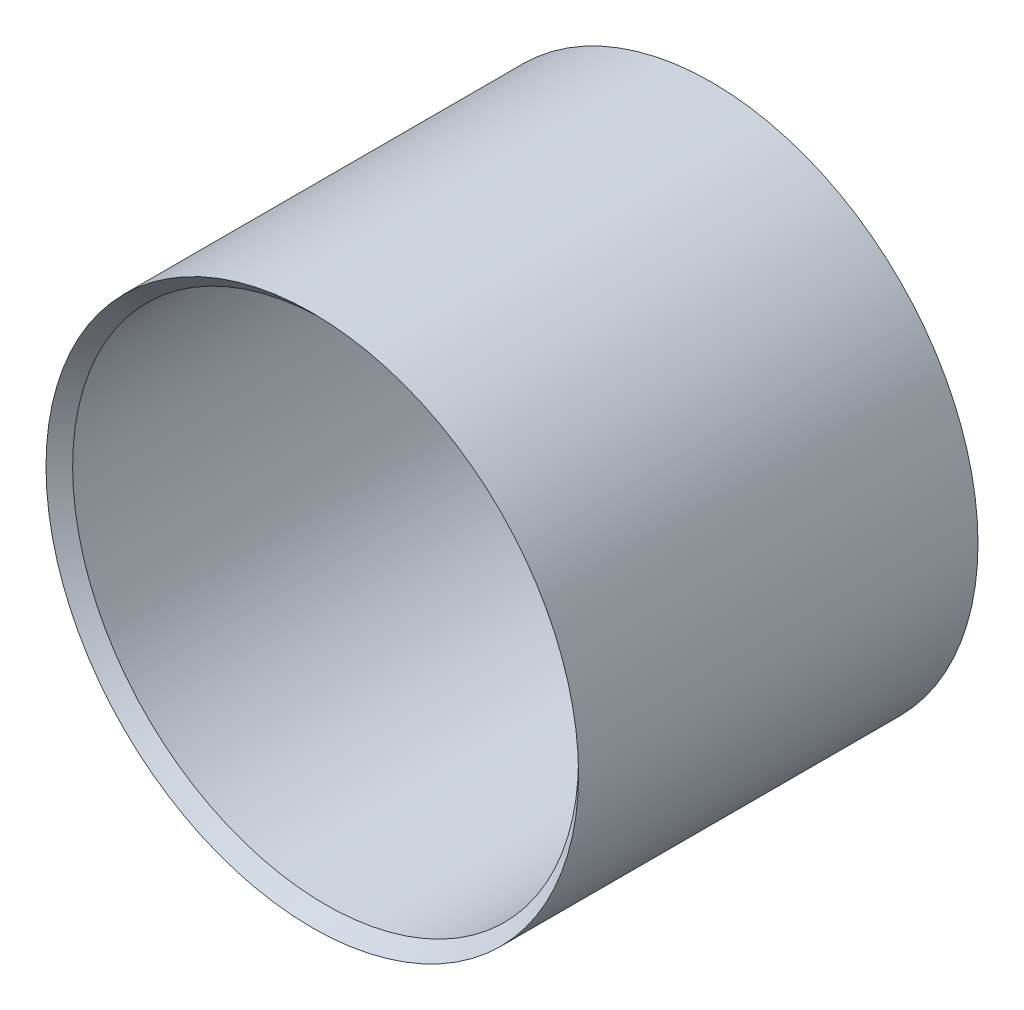
ISO-10303-21;
HEADER;
FILE_DESCRIPTION(('STEP AP214'),'2;1');
FILE_NAME('part.step','',(''),(''),'','','');
FILE_SCHEMA(('AUTOMOTIVE_DESIGN { 1 0 10303 214 1 1 1 1 }'));
ENDSEC;
DATA;
#1=APPLICATION_CONTEXT('core data for automotive mechanical design processes');
#2=APPLICATION_PROTOCOL_DEFINITION('international standard','automotive_design',2000,#1);
#3=PRODUCT_CONTEXT('',#1,'mechanical');
#4=PRODUCT('Part','Part','',(#3));
#5=PRODUCT_RELATED_PRODUCT_CATEGORY('part','',(#4));
#6=PRODUCT_DEFINITION_FORMATION('','',#4);
#7=PRODUCT_DEFINITION_CONTEXT('part definition',#1,'design');
#8=PRODUCT_DEFINITION('design','',#6,#7);
#9=PRODUCT_DEFINITION_SHAPE('','',#8);
#10=(LENGTH_UNIT() NAMED_UNIT(*) SI_UNIT(.MILLI.,.METRE.));
#11=(NAMED_UNIT(*) PLANE_ANGLE_UNIT() SI_UNIT($,.RADIAN.));
#12=(NAMED_UNIT(*) SI_UNIT($,.STERADIAN.) SOLID_ANGLE_UNIT());
#13=UNCERTAINTY_MEASURE_WITH_UNIT(LENGTH_MEASURE(1.E-05),#10,'distance_accuracy_value','');
#14=(GEOMETRIC_REPRESENTATION_CONTEXT(3) GLOBAL_UNCERTAINTY_ASSIGNED_CONTEXT((#13)) GLOBAL_UNIT_ASSIGNED_CONTEXT((#10,
#11,#12)) REPRESENTATION_CONTEXT('',''));
#15=CARTESIAN_POINT('',(0.,0.,0.));
#16=DIRECTION('',(0.,0.,1.));
#17=DIRECTION('',(1.,0.,0.));
#18=AXIS2_PLACEMENT_3D('',#15,#16,#17);
#19=CARTESIAN_POINT('',(0.,0.,16.));
#20=DIRECTION('',(0.,0.,-1.));
#21=DIRECTION('',(-1.,0.,0.));
#22=AXIS2_PLACEMENT_3D('',#19,#20,#21);
#23=CYLINDRICAL_SURFACE('',#22,10.);
#24=CARTESIAN_POINT('',(0.,0.,0.500000000000013));
#25=DIRECTION('',(0.,0.,-1.));
#26=DIRECTION('',(-1.,0.,0.));
#27=AXIS2_PLACEMENT_3D('',#24,#25,#26);
#28=CIRCLE('',#27,10.);
#29=CARTESIAN_POINT('',(-10.,0.,0.500000000000013));
#30=VERTEX_POINT('',#29);
#31=EDGE_CURVE('E49',#30,#30,#28,.F.);
#32=ORIENTED_EDGE('',*,*,#31,.T.);
#33=EDGE_LOOP('',(#32));
#34=FACE_BOUND('',#33,.T.);
#35=CARTESIAN_POINT('',(0.,0.,15.5));
#36=DIRECTION('',(0.,0.,1.));
#37=DIRECTION('',(1.,0.,0.));
#38=AXIS2_PLACEMENT_3D('',#35,#36,#37);
#39=CIRCLE('',#38,10.);
#40=CARTESIAN_POINT('',(10.,0.,15.5));
#41=VERTEX_POINT('',#40);
#42=EDGE_CURVE('E53',#41,#41,#39,.F.);
#43=ORIENTED_EDGE('',*,*,#42,.T.);
#44=EDGE_LOOP('',(#43));
#45=FACE_BOUND('',#44,.T.);
#46=ADVANCED_FACE('F37',(#34,#45),#23,.T.);
#47=CARTESIAN_POINT('',(0.,0.,16.));
#48=DIRECTION('',(0.,0.,-1.));
#49=DIRECTION('',(-1.,0.,0.));
#50=AXIS2_PLACEMENT_3D('',#47,#48,#49);
#51=CYLINDRICAL_SURFACE('',#50,9.5);
#52=CARTESIAN_POINT('',(0.,0.,1.00000000000001));
#53=DIRECTION('',(0.,0.,1.));
#54=DIRECTION('',(1.,0.,0.));
#55=AXIS2_PLACEMENT_3D('',#52,#53,#54);
#56=CIRCLE('',#55,9.5);
#57=CARTESIAN_POINT('',(9.5,0.,1.00000000000001));
#58=VERTEX_POINT('',#57);
#59=EDGE_CURVE('E10',#58,#58,#56,.F.);
#60=ORIENTED_EDGE('',*,*,#59,.T.);
#61=EDGE_LOOP('',(#60));
#62=FACE_BOUND('',#61,.T.);
#63=CARTESIAN_POINT('',(0.,0.,15.));
#64=DIRECTION('',(0.,0.,1.));
#65=DIRECTION('',(1.,0.,0.));
#66=AXIS2_PLACEMENT_3D('',#63,#64,#65);
#67=CIRCLE('',#66,9.5);
#68=CARTESIAN_POINT('',(9.5,0.,15.));
#69=VERTEX_POINT('',#68);
#70=EDGE_CURVE('E45',#69,#69,#67,.T.);
#71=ORIENTED_EDGE('',*,*,#70,.T.);
#72=EDGE_LOOP('',(#71));
#73=FACE_BOUND('',#72,.T.);
#74=ADVANCED_FACE('F66',(#62,#73),#51,.F.);
#75=CARTESIAN_POINT('',(0.,0.,0.));
#76=DIRECTION('',(0.,0.,-1.));
#77=DIRECTION('',(-1.,0.,0.));
#78=AXIS2_PLACEMENT_3D('',#75,#76,#77);
#79=CONICAL_SURFACE('',#78,10.5,0.785398163397453);
#80=ORIENTED_EDGE('',*,*,#59,.F.);
#81=EDGE_LOOP('',(#80));
#82=FACE_BOUND('',#81,.T.);
#83=ORIENTED_EDGE('',*,*,#31,.F.);
#84=EDGE_LOOP('',(#83));
#85=FACE_BOUND('',#84,.T.);
#86=ADVANCED_FACE('F62',(#82,#85),#79,.F.);
#87=CARTESIAN_POINT('',(0.,0.,15.));
#88=DIRECTION('',(0.,0.,1.));
#89=DIRECTION('',(1.,0.,0.));
#90=AXIS2_PLACEMENT_3D('',#87,#88,#89);
#91=CONICAL_SURFACE('',#90,9.5,0.785398163397443);
#92=ORIENTED_EDGE('',*,*,#42,.F.);
#93=EDGE_LOOP('',(#92));
#94=FACE_BOUND('',#93,.T.);
#95=ORIENTED_EDGE('',*,*,#70,.F.);
#96=EDGE_LOOP('',(#95));
#97=FACE_BOUND('',#96,.T.);
#98=ADVANCED_FACE('F40',(#94,#97),#91,.F.);
#99=CLOSED_SHELL('',(#46,#74,#86,#98));
#100=MANIFOLD_SOLID_BREP('B2',#99);
#101=ADVANCED_BREP_SHAPE_REPRESENTATION('',(#18,#100),#14);
#102=SHAPE_DEFINITION_REPRESENTATION(#9,#101);
ENDSEC;
END-ISO-10303-21;
